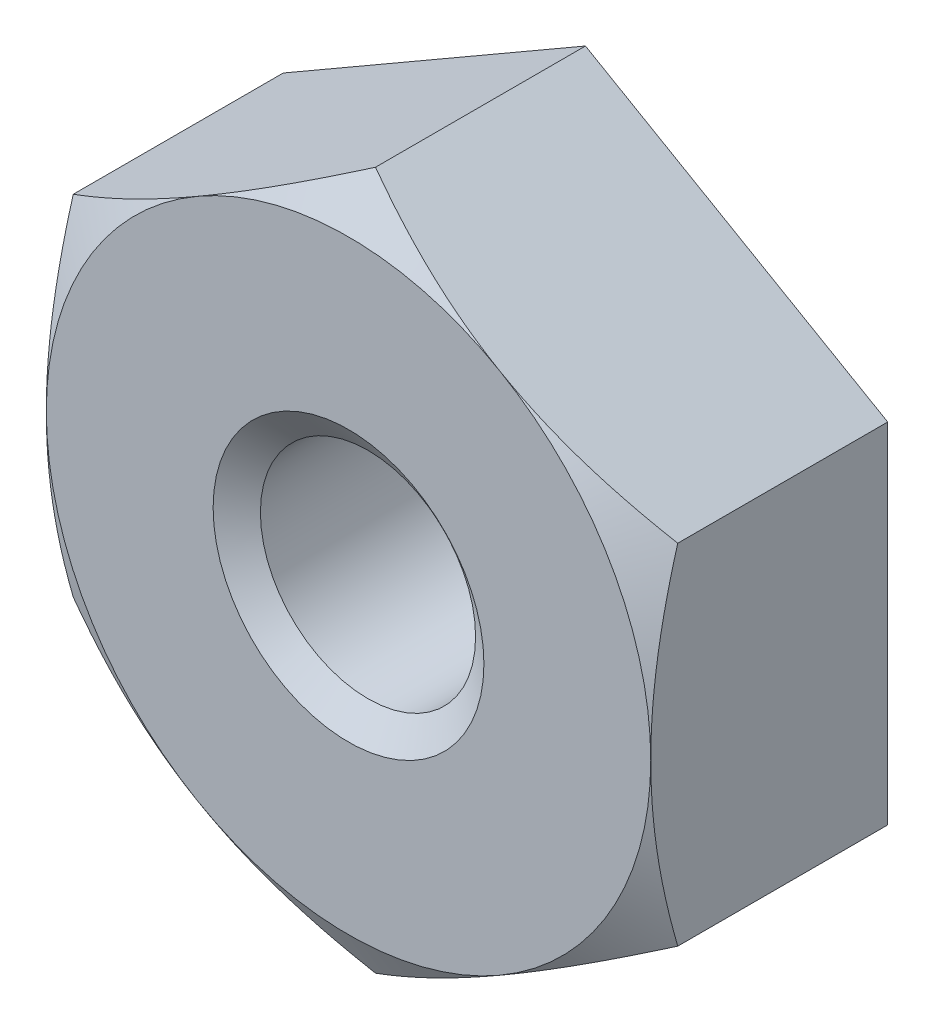
ISO-10303-21;
HEADER;
FILE_DESCRIPTION(('STEP AP214'),'2;1');
FILE_NAME('part.step','',(''),(''),'','','');
FILE_SCHEMA(('AUTOMOTIVE_DESIGN { 1 0 10303 214 1 1 1 1 }'));
ENDSEC;
DATA;
#1=APPLICATION_CONTEXT('core data for automotive mechanical design processes');
#2=APPLICATION_PROTOCOL_DEFINITION('international standard','automotive_design',2000,#1);
#3=PRODUCT_CONTEXT('',#1,'mechanical');
#4=PRODUCT('Part','Part','',(#3));
#5=PRODUCT_RELATED_PRODUCT_CATEGORY('part','',(#4));
#6=PRODUCT_DEFINITION_FORMATION('','',#4);
#7=PRODUCT_DEFINITION_CONTEXT('part definition',#1,'design');
#8=PRODUCT_DEFINITION('design','',#6,#7);
#9=PRODUCT_DEFINITION_SHAPE('','',#8);
#10=(LENGTH_UNIT() NAMED_UNIT(*) SI_UNIT(.MILLI.,.METRE.));
#11=(NAMED_UNIT(*) PLANE_ANGLE_UNIT() SI_UNIT($,.RADIAN.));
#12=(NAMED_UNIT(*) SI_UNIT($,.STERADIAN.) SOLID_ANGLE_UNIT());
#13=UNCERTAINTY_MEASURE_WITH_UNIT(LENGTH_MEASURE(1.E-05),#10,'distance_accuracy_value','');
#14=(GEOMETRIC_REPRESENTATION_CONTEXT(3) GLOBAL_UNCERTAINTY_ASSIGNED_CONTEXT((#13)) GLOBAL_UNIT_ASSIGNED_CONTEXT((#10,
#11,#12)) REPRESENTATION_CONTEXT('',''));
#15=CARTESIAN_POINT('',(0.,0.,0.));
#16=DIRECTION('',(0.,0.,1.));
#17=DIRECTION('',(1.,0.,0.));
#18=AXIS2_PLACEMENT_3D('',#15,#16,#17);
#19=CARTESIAN_POINT('',(0.,3.66617420935413,-2.4892));
#20=DIRECTION('',(0.,0.,-1.));
#21=DIRECTION('',(-1.,0.,0.));
#22=AXIS2_PLACEMENT_3D('',#19,#20,#21);
#23=PLANE('',#22);
#24=DIRECTION('',(-0.866025403784437,-0.500000000000002,0.));
#25=VECTOR('',#24,1.);
#26=CARTESIAN_POINT('',(0.,3.66617420935413,-2.4892));
#27=LINE('',#26,#25);
#28=CARTESIAN_POINT('',(0.,3.66617420935413,-2.4892));
#29=VERTEX_POINT('',#28);
#30=CARTESIAN_POINT('',(-3.175,1.83308710467706,-2.4892));
#31=VERTEX_POINT('',#30);
#32=EDGE_CURVE('E231',#29,#31,#27,.T.);
#33=ORIENTED_EDGE('',*,*,#32,.F.);
#34=DIRECTION('',(-0.866025403784438,0.500000000000001,0.));
#35=VECTOR('',#34,1.);
#36=CARTESIAN_POINT('',(3.175,1.83308710467706,-2.4892));
#37=LINE('',#36,#35);
#38=CARTESIAN_POINT('',(3.175,1.83308710467706,-2.4892));
#39=VERTEX_POINT('',#38);
#40=EDGE_CURVE('E496',#39,#29,#37,.T.);
#41=ORIENTED_EDGE('',*,*,#40,.F.);
#42=DIRECTION('',(0.,-1.,0.));
#43=VECTOR('',#42,1.);
#44=CARTESIAN_POINT('',(3.175,1.83308710467706,-2.4892));
#45=LINE('',#44,#43);
#46=CARTESIAN_POINT('',(3.175,-1.83308710467707,-2.4892));
#47=VERTEX_POINT('',#46);
#48=EDGE_CURVE('E491',#39,#47,#45,.T.);
#49=ORIENTED_EDGE('',*,*,#48,.T.);
#50=DIRECTION('',(0.866025403784438,0.500000000000002,0.));
#51=VECTOR('',#50,1.);
#52=CARTESIAN_POINT('',(0.,-3.66617420935414,-2.4892));
#53=LINE('',#52,#51);
#54=CARTESIAN_POINT('',(0.,-3.66617420935414,-2.4892));
#55=VERTEX_POINT('',#54);
#56=EDGE_CURVE('E485',#55,#47,#53,.T.);
#57=ORIENTED_EDGE('',*,*,#56,.F.);
#58=DIRECTION('',(0.866025403784438,-0.500000000000001,0.));
#59=VECTOR('',#58,1.);
#60=CARTESIAN_POINT('',(-3.175,-1.83308710467707,-2.4892));
#61=LINE('',#60,#59);
#62=CARTESIAN_POINT('',(-3.175,-1.83308710467707,-2.4892));
#63=VERTEX_POINT('',#62);
#64=EDGE_CURVE('E479',#63,#55,#61,.T.);
#65=ORIENTED_EDGE('',*,*,#64,.F.);
#66=DIRECTION('',(0.,-1.,0.));
#67=VECTOR('',#66,1.);
#68=CARTESIAN_POINT('',(-3.175,1.83308710467706,-2.4892));
#69=LINE('',#68,#67);
#70=EDGE_CURVE('E473',#31,#63,#69,.T.);
#71=ORIENTED_EDGE('',*,*,#70,.F.);
#72=EDGE_LOOP('',(#33,#41,#49,#57,#65,#71));
#73=FACE_BOUND('',#72,.T.);
#74=CARTESIAN_POINT('',(0.,0.,-2.4892));
#75=DIRECTION('',(0.,0.,-1.));
#76=DIRECTION('',(-1.,0.,0.));
#77=AXIS2_PLACEMENT_3D('',#74,#75,#76);
#78=CIRCLE('',#77,1.4224);
#79=CARTESIAN_POINT('',(-1.4224,0.,-2.4892));
#80=VERTEX_POINT('',#79);
#81=EDGE_CURVE('E235',#80,#80,#78,.F.);
#82=ORIENTED_EDGE('',*,*,#81,.T.);
#83=EDGE_LOOP('',(#82));
#84=FACE_BOUND('',#83,.T.);
#85=ADVANCED_FACE('F15',(#73,#84),#23,.T.);
#86=CARTESIAN_POINT('',(0.,3.66617420935413,0.));
#87=DIRECTION('',(0.,0.,-1.));
#88=DIRECTION('',(-1.,0.,0.));
#89=AXIS2_PLACEMENT_3D('',#86,#87,#88);
#90=PLANE('',#89);
#91=CARTESIAN_POINT('',(0.,0.,0.));
#92=DIRECTION('',(0.,0.,-1.));
#93=DIRECTION('',(-1.,0.,0.));
#94=AXIS2_PLACEMENT_3D('',#91,#92,#93);
#95=CIRCLE('',#94,3.175);
#96=CARTESIAN_POINT('',(-1.58750000000001,2.74963065701559,0.));
#97=VERTEX_POINT('',#96);
#98=CARTESIAN_POINT('',(-3.175,0.,0.));
#99=VERTEX_POINT('',#98);
#100=EDGE_CURVE('E20',#97,#99,#95,.F.);
#101=ORIENTED_EDGE('',*,*,#100,.T.);
#102=CARTESIAN_POINT('',(-1.5875,-2.74963065701559,0.));
#103=VERTEX_POINT('',#102);
#104=EDGE_CURVE('E10',#99,#103,#95,.F.);
#105=ORIENTED_EDGE('',*,*,#104,.T.);
#106=CARTESIAN_POINT('',(1.58750000000001,-2.74963065701559,0.));
#107=VERTEX_POINT('',#106);
#108=EDGE_CURVE('E26',#103,#107,#95,.F.);
#109=ORIENTED_EDGE('',*,*,#108,.T.);
#110=CARTESIAN_POINT('',(3.175,0.,0.));
#111=VERTEX_POINT('',#110);
#112=EDGE_CURVE('E116',#107,#111,#95,.F.);
#113=ORIENTED_EDGE('',*,*,#112,.T.);
#114=CARTESIAN_POINT('',(0.,0.,0.));
#115=DIRECTION('',(0.,0.,1.));
#116=DIRECTION('',(1.,0.,0.));
#117=AXIS2_PLACEMENT_3D('',#114,#115,#116);
#118=CIRCLE('',#117,3.175);
#119=CARTESIAN_POINT('',(1.5875,2.74963065701559,0.));
#120=VERTEX_POINT('',#119);
#121=EDGE_CURVE('E129',#111,#120,#118,.T.);
#122=ORIENTED_EDGE('',*,*,#121,.T.);
#123=EDGE_CURVE('E146',#120,#97,#95,.F.);
#124=ORIENTED_EDGE('',*,*,#123,.T.);
#125=EDGE_LOOP('',(#101,#105,#109,#113,#122,#124));
#126=FACE_BOUND('',#125,.T.);
#127=CARTESIAN_POINT('',(0.,0.,0.));
#128=DIRECTION('',(0.,0.,1.));
#129=DIRECTION('',(1.,0.,0.));
#130=AXIS2_PLACEMENT_3D('',#127,#128,#129);
#131=CIRCLE('',#130,1.4224);
#132=CARTESIAN_POINT('',(1.4224,0.,0.));
#133=VERTEX_POINT('',#132);
#134=EDGE_CURVE('E239',#133,#133,#131,.T.);
#135=ORIENTED_EDGE('',*,*,#134,.F.);
#136=EDGE_LOOP('',(#135));
#137=FACE_BOUND('',#136,.T.);
#138=ADVANCED_FACE('F142',(#126,#137),#90,.F.);
#139=CARTESIAN_POINT('',(0.,3.66617420935413,-2.4892));
#140=DIRECTION('',(-0.500000000000002,0.866025403784438,0.));
#141=DIRECTION('',(-0.866025403784438,-0.500000000000002,0.));
#142=AXIS2_PLACEMENT_3D('',#139,#140,#141);
#143=PLANE('',#142);
#144=DIRECTION('',(0.,0.,1.));
#145=VECTOR('',#144,1.);
#146=CARTESIAN_POINT('',(-3.175,1.83308710467706,-2.4892));
#147=LINE('',#146,#145);
#148=CARTESIAN_POINT('',(-3.175,1.83308710467706,-0.283579561989607));
#149=VERTEX_POINT('',#148);
#150=EDGE_CURVE('E501',#31,#149,#147,.T.);
#151=ORIENTED_EDGE('',*,*,#150,.T.);
#152=CARTESIAN_POINT('',(-3.1752,1.83297163462322,-0.283646231805778));
#153=CARTESIAN_POINT('',(-3.03567460326018,1.91352665998974,-0.237119934023207));
#154=CARTESIAN_POINT('',(-2.89494483272887,1.99477703088899,-0.194805864908322));
#155=CARTESIAN_POINT('',(-2.61104837470026,2.15868472735379,-0.120946008708286));
#156=CARTESIAN_POINT('',(-2.46787664251628,2.24134496547055,-0.0894263509090421));
#157=CARTESIAN_POINT('',(-2.18330753500983,2.40564101629246,-0.0403611049832709));
#158=CARTESIAN_POINT('',(-2.0419539457708,2.48725154909053,-0.0224889669031262));
#159=CARTESIAN_POINT('',(-1.75858160224329,2.65085664790703,-0.00115281403229686));
#160=CARTESIAN_POINT('',(-1.61656387803407,2.73285061920892,0.00232886836810175));
#161=CARTESIAN_POINT('',(-1.35119263453263,2.88606277807967,-0.00491170072221306));
#162=CARTESIAN_POINT('',(-1.22779940341379,2.95730389328231,-0.013856146143631));
#163=CARTESIAN_POINT('',(-0.981816852669883,3.09932198517026,-0.0422055763684445));
#164=CARTESIAN_POINT('',(-0.859228383940737,3.17009847059057,-0.0616202467099069));
#165=CARTESIAN_POINT('',(-0.612738605574497,3.31240941048281,-0.110155730811223));
#166=CARTESIAN_POINT('',(-0.488868495421441,3.38392585192423,-0.139482298472806));
#167=CARTESIAN_POINT('',(-0.242975839646995,3.52589204292736,-0.20604219366216));
#168=CARTESIAN_POINT('',(-0.120950143425913,3.59634361148865,-0.243259880449916));
#169=CARTESIAN_POINT('',(0.000199999999999186,3.66628967940796,-0.283646231805781));
#170=B_SPLINE_CURVE_WITH_KNOTS('',3,(#152,#153,#154,#155,#156,#157,#158,#159,#160,#161,#162,
#163,#164,#165,#166,#167,#168,#169),.UNSPECIFIED.,.F.,.F.,(4,2,2,2,2,2,2,2,4),(0.,
0.503278731073368,1.00776724301492,1.49976968502821,1.99116790059651,2.41904879402149,
2.84732618162394,3.28510386250597,3.72202181665389),.UNSPECIFIED.);
#171=EDGE_CURVE('E45',#149,#97,#170,.T.);
#172=ORIENTED_EDGE('',*,*,#171,.T.);
#173=CARTESIAN_POINT('',(0.,3.66617420935413,-0.283579561989607));
#174=VERTEX_POINT('',#173);
#175=EDGE_CURVE('E159',#97,#174,#170,.T.);
#176=ORIENTED_EDGE('',*,*,#175,.T.);
#177=DIRECTION('',(0.,0.,1.));
#178=VECTOR('',#177,1.);
#179=CARTESIAN_POINT('',(0.,3.66617420935413,-2.4892));
#180=LINE('',#179,#178);
#181=EDGE_CURVE('E526',#29,#174,#180,.T.);
#182=ORIENTED_EDGE('',*,*,#181,.F.);
#183=ORIENTED_EDGE('',*,*,#32,.T.);
#184=EDGE_LOOP('',(#151,#172,#176,#182,#183));
#185=FACE_BOUND('',#184,.T.);
#186=ADVANCED_FACE('F17',(#185),#143,.T.);
#187=CARTESIAN_POINT('',(3.175,1.83308710467706,-2.4892));
#188=DIRECTION('',(0.500000000000001,0.866025403784438,0.));
#189=DIRECTION('',(-0.866025403784438,0.500000000000001,0.));
#190=AXIS2_PLACEMENT_3D('',#187,#188,#189);
#191=PLANE('',#190);
#192=ORIENTED_EDGE('',*,*,#181,.T.);
#193=CARTESIAN_POINT('',(-0.000200000000001121,3.66628967940796,-0.283646231805781));
#194=CARTESIAN_POINT('',(0.139325396739818,3.58573465404144,-0.23711993402321));
#195=CARTESIAN_POINT('',(0.280055167271128,3.50448428314219,-0.194805864908325));
#196=CARTESIAN_POINT('',(0.563951625299741,3.34057658667739,-0.120946008708289));
#197=CARTESIAN_POINT('',(0.707123357483717,3.25791634856063,-0.0894263509090441));
#198=CARTESIAN_POINT('',(0.991692464990167,3.09362029773873,-0.0403611049832722));
#199=CARTESIAN_POINT('',(1.1330460542292,3.01200976494065,-0.0224889669031271));
#200=CARTESIAN_POINT('',(1.41641839775671,2.84840466612415,-0.00115281403229733));
#201=CARTESIAN_POINT('',(1.55843612196593,2.76641069482226,0.0023288683681013));
#202=CARTESIAN_POINT('',(1.82380736546737,2.61319853595151,-0.00491170072221313));
#203=CARTESIAN_POINT('',(1.94720059658621,2.54195742074887,-0.0138561461436307));
#204=CARTESIAN_POINT('',(2.19318314733012,2.39993932886093,-0.0422055763684437));
#205=CARTESIAN_POINT('',(2.31577161605926,2.32916284344061,-0.0616202467099058));
#206=CARTESIAN_POINT('',(2.5622613944255,2.18685190354837,-0.110155730811222));
#207=CARTESIAN_POINT('',(2.68613150457856,2.11533546210696,-0.139482298472804));
#208=CARTESIAN_POINT('',(2.93202416035301,1.97336927110383,-0.206042193662158));
#209=CARTESIAN_POINT('',(3.05404985657409,1.90291770254253,-0.243259880449914));
#210=CARTESIAN_POINT('',(3.1752,1.83297163462322,-0.283646231805778));
#211=B_SPLINE_CURVE_WITH_KNOTS('',3,(#193,#194,#195,#196,#197,#198,#199,#200,#201,#202,#203,
#204,#205,#206,#207,#208,#209,#210),.UNSPECIFIED.,.F.,.F.,(4,2,2,2,2,2,2,2,4),(0.,
0.503278731073369,1.00776724301492,1.49976968502821,1.99116790059651,2.41904879402149,
2.84732618162394,3.28510386250597,3.72202181665389),.UNSPECIFIED.);
#212=EDGE_CURVE('E156',#174,#120,#211,.T.);
#213=ORIENTED_EDGE('',*,*,#212,.T.);
#214=CARTESIAN_POINT('',(3.175,1.83308710467707,-0.283579561989607));
#215=VERTEX_POINT('',#214);
#216=EDGE_CURVE('E132',#120,#215,#211,.T.);
#217=ORIENTED_EDGE('',*,*,#216,.T.);
#218=DIRECTION('',(0.,0.,1.));
#219=VECTOR('',#218,1.);
#220=CARTESIAN_POINT('',(3.175,1.83308710467706,-2.4892));
#221=LINE('',#220,#219);
#222=EDGE_CURVE('E150',#39,#215,#221,.T.);
#223=ORIENTED_EDGE('',*,*,#222,.F.);
#224=ORIENTED_EDGE('',*,*,#40,.T.);
#225=EDGE_LOOP('',(#192,#213,#217,#223,#224));
#226=FACE_BOUND('',#225,.T.);
#227=ADVANCED_FACE('F364',(#226),#191,.T.);
#228=CARTESIAN_POINT('',(3.175,1.83308710467706,-2.4892));
#229=DIRECTION('',(-1.,0.,0.));
#230=DIRECTION('',(0.,0.,1.));
#231=AXIS2_PLACEMENT_3D('',#228,#229,#230);
#232=PLANE('',#231);
#233=CARTESIAN_POINT('',(3.175,-4.8616171420299,-1.51932228935976));
#234=CARTESIAN_POINT('',(3.175,-4.7222166877445,-1.45195628992123));
#235=CARTESIAN_POINT('',(3.175,-4.58248664475634,-1.38525996427212));
#236=CARTESIAN_POINT('',(3.175,-4.30218917292502,-1.25358933527025));
#237=CARTESIAN_POINT('',(3.175,-4.16162160419068,-1.18861533006649));
#238=CARTESIAN_POINT('',(3.175,-3.87871153776028,-1.06042973005273));
#239=CARTESIAN_POINT('',(3.175,-3.73636348618431,-0.997230348581289));
#240=CARTESIAN_POINT('',(3.175,-3.4504974070564,-0.873546152177363));
#241=CARTESIAN_POINT('',(3.175,-3.30697944095183,-0.813061195746994));
#242=CARTESIAN_POINT('',(3.175,-3.01676360978826,-0.694809578750527));
#243=CARTESIAN_POINT('',(3.175,-2.87004833678074,-0.637085406846329));
#244=CARTESIAN_POINT('',(3.175,-2.57488727143506,-0.526158008324041));
#245=CARTESIAN_POINT('',(3.175,-2.42644128864792,-0.472955284693414));
#246=CARTESIAN_POINT('',(3.175,-2.12788752613931,-0.372500325317014));
#247=CARTESIAN_POINT('',(3.175,-1.97778404697074,-0.325235438859672));
#248=CARTESIAN_POINT('',(3.175,-1.67544317117207,-0.238191164257203));
#249=CARTESIAN_POINT('',(3.175,-1.52320646578688,-0.198409408930923));
#250=CARTESIAN_POINT('',(3.175,-1.21649515954196,-0.128262693494771));
#251=CARTESIAN_POINT('',(3.175,-1.06201997425122,-0.0979002407280043));
#252=CARTESIAN_POINT('',(3.175,-0.751207163661342,-0.0486364247633605));
#253=CARTESIAN_POINT('',(3.175,-0.594869536715697,-0.0297350716985363));
#254=CARTESIAN_POINT('',(3.175,-0.282140016767181,-0.00506556418736515));
#255=CARTESIAN_POINT('',(3.175,-0.125754853180873,0.000785733729076548));
#256=CARTESIAN_POINT('',(3.175,0.186905967950927,-0.00095572768499411));
#257=CARTESIAN_POINT('',(3.175,0.343181643385311,-0.00854499720968487));
#258=CARTESIAN_POINT('',(3.175,0.610045004210252,-0.0324474955995379));
#259=CARTESIAN_POINT('',(3.175,0.720927103340567,-0.0456480037348537));
#260=CARTESIAN_POINT('',(3.175,0.941834770691507,-0.0779568944626868));
#261=CARTESIAN_POINT('',(3.175,1.05186020102054,-0.097066208790142));
#262=CARTESIAN_POINT('',(3.175,1.38056179828294,-0.162254462566746));
#263=CARTESIAN_POINT('',(3.175,1.59769723107173,-0.216176928599965));
#264=CARTESIAN_POINT('',(3.175,1.92260738330278,-0.30917861020803));
#265=CARTESIAN_POINT('',(3.175,2.03207569486971,-0.342672941312986));
#266=CARTESIAN_POINT('',(3.175,2.24986976286739,-0.412975885555787));
#267=CARTESIAN_POINT('',(3.175,2.35819625057448,-0.449782212723362));
#268=CARTESIAN_POINT('',(3.175,2.57325368409845,-0.525943273724352));
#269=CARTESIAN_POINT('',(3.175,2.67999017870302,-0.565282497316841));
#270=CARTESIAN_POINT('',(3.175,2.89263503540125,-0.64626994332137));
#271=CARTESIAN_POINT('',(3.175,2.99854304277513,-0.687919098952175));
#272=CARTESIAN_POINT('',(3.175,3.1040681107068,-0.730495273942548));
#273=B_SPLINE_CURVE_WITH_KNOTS('',3,(#233,#234,#235,#236,#237,#238,#239,#240,#241,#242,#243,
#244,#245,#246,#247,#248,#249,#250,#251,#252,#253,#254,#255,#256,#257,#258,#259,#260,#261,#262,
#263,#264,#265,#266,#267,#268,#269,#270,#271,#272),.UNSPECIFIED.,.F.,.F.,(4,2,2,2,2,2,2,2,2,2,2,
2,2,2,2,2,2,2,2,4),(0.,0.464480110322491,0.929040108038169,1.39625859500254,1.86345269838581,
2.33638249541753,2.80936483473485,3.28132173853721,3.7531290935448,4.22506193235102,
4.69699518840458,5.16591300646642,5.63470908917535,5.96954086780258,6.30442547160104,
6.97469308766865,7.31809942506291,7.66127053211061,8.00251004161233,8.34388843151022),.UNSPECIFIED.);
#274=CARTESIAN_POINT('',(3.175,-1.83308710467707,-0.283579561989607));
#275=VERTEX_POINT('',#274);
#276=EDGE_CURVE('E112',#275,#111,#273,.T.);
#277=ORIENTED_EDGE('',*,*,#276,.F.);
#278=DIRECTION('',(0.,0.,1.));
#279=VECTOR('',#278,1.);
#280=CARTESIAN_POINT('',(3.175,-1.83308710467707,-2.4892));
#281=LINE('',#280,#279);
#282=EDGE_CURVE('E517',#47,#275,#281,.T.);
#283=ORIENTED_EDGE('',*,*,#282,.F.);
#284=ORIENTED_EDGE('',*,*,#48,.F.);
#285=ORIENTED_EDGE('',*,*,#222,.T.);
#286=EDGE_CURVE('E126',#111,#215,#273,.T.);
#287=ORIENTED_EDGE('',*,*,#286,.F.);
#288=EDGE_LOOP('',(#277,#283,#284,#285,#287));
#289=FACE_BOUND('',#288,.T.);
#290=ADVANCED_FACE('F148',(#289),#232,.F.);
#291=CARTESIAN_POINT('',(0.,-3.66617420935414,-2.4892));
#292=DIRECTION('',(0.500000000000002,-0.866025403784438,0.));
#293=DIRECTION('',(0.866025403784438,0.500000000000002,0.));
#294=AXIS2_PLACEMENT_3D('',#291,#292,#293);
#295=PLANE('',#294);
#296=ORIENTED_EDGE('',*,*,#282,.T.);
#297=CARTESIAN_POINT('',(3.1752,-1.83297163462323,-0.283646231805781));
#298=CARTESIAN_POINT('',(3.03567460326018,-1.91352665998975,-0.23711993402321));
#299=CARTESIAN_POINT('',(2.89494483272887,-1.994777030889,-0.194805864908326));
#300=CARTESIAN_POINT('',(2.61104837470026,-2.1586847273538,-0.12094600870829));
#301=CARTESIAN_POINT('',(2.46787664251628,-2.24134496547057,-0.0894263509090457));
#302=CARTESIAN_POINT('',(2.18330753500983,-2.40564101629247,-0.0403611049832748));
#303=CARTESIAN_POINT('',(2.0419539457708,-2.48725154909054,-0.0224889669031304));
#304=CARTESIAN_POINT('',(1.75858160224329,-2.65085664790704,-0.00115281403230171));
#305=CARTESIAN_POINT('',(1.61656387803407,-2.73285061920894,0.0023288683680965));
#306=CARTESIAN_POINT('',(1.35119263453262,-2.88606277807968,-0.00491170072221867));
#307=CARTESIAN_POINT('',(1.22779940341379,-2.95730389328232,-0.0138561461436366));
#308=CARTESIAN_POINT('',(0.981816852669881,-3.09932198517027,-0.0422055763684503));
#309=CARTESIAN_POINT('',(0.859228383940735,-3.17009847059058,-0.0616202467099128));
#310=CARTESIAN_POINT('',(0.612738605574496,-3.31240941048282,-0.110155730811229));
#311=CARTESIAN_POINT('',(0.488868495421441,-3.38392585192424,-0.139482298472812));
#312=CARTESIAN_POINT('',(0.242975839646995,-3.52589204292737,-0.206042193662165));
#313=CARTESIAN_POINT('',(0.120950143425914,-3.59634361148866,-0.243259880449921));
#314=CARTESIAN_POINT('',(-0.000199999999998958,-3.66628967940797,-0.283646231805786));
#315=B_SPLINE_CURVE_WITH_KNOTS('',3,(#297,#298,#299,#300,#301,#302,#303,#304,#305,#306,#307,
#308,#309,#310,#311,#312,#313,#314),.UNSPECIFIED.,.F.,.F.,(4,2,2,2,2,2,2,2,4),(0.,
0.503278731073368,1.00776724301492,1.49976968502821,1.99116790059651,2.41904879402149,
2.84732618162394,3.28510386250597,3.72202181665389),.UNSPECIFIED.);
#316=EDGE_CURVE('E119',#275,#107,#315,.T.);
#317=ORIENTED_EDGE('',*,*,#316,.T.);
#318=CARTESIAN_POINT('',(0.,-3.66617420935413,-0.283579561989607));
#319=VERTEX_POINT('',#318);
#320=EDGE_CURVE('E166',#107,#319,#315,.T.);
#321=ORIENTED_EDGE('',*,*,#320,.T.);
#322=DIRECTION('',(0.,0.,1.));
#323=VECTOR('',#322,1.);
#324=CARTESIAN_POINT('',(0.,-3.66617420935414,-2.4892));
#325=LINE('',#324,#323);
#326=EDGE_CURVE('E511',#55,#319,#325,.T.);
#327=ORIENTED_EDGE('',*,*,#326,.F.);
#328=ORIENTED_EDGE('',*,*,#56,.T.);
#329=EDGE_LOOP('',(#296,#317,#321,#327,#328));
#330=FACE_BOUND('',#329,.T.);
#331=ADVANCED_FACE('F209',(#330),#295,.T.);
#332=CARTESIAN_POINT('',(-3.175,-1.83308710467707,-2.4892));
#333=DIRECTION('',(-0.500000000000001,-0.866025403784438,0.));
#334=DIRECTION('',(0.866025403784438,-0.500000000000001,0.));
#335=AXIS2_PLACEMENT_3D('',#332,#333,#334);
#336=PLANE('',#335);
#337=ORIENTED_EDGE('',*,*,#326,.T.);
#338=CARTESIAN_POINT('',(0.000200000000000814,-3.66628967940797,-0.283646231805787));
#339=CARTESIAN_POINT('',(-0.139325396739818,-3.58573465404145,-0.237119934023216));
#340=CARTESIAN_POINT('',(-0.280055167271129,-3.5044842831422,-0.194805864908331));
#341=CARTESIAN_POINT('',(-0.563951625299743,-3.3405765866774,-0.120946008708294));
#342=CARTESIAN_POINT('',(-0.70712335748372,-3.25791634856064,-0.089426350909049));
#343=CARTESIAN_POINT('',(-0.99169246499017,-3.09362029773874,-0.0403611049832773));
#344=CARTESIAN_POINT('',(-1.1330460542292,-3.01200976494066,-0.0224889669031325));
#345=CARTESIAN_POINT('',(-1.41641839775671,-2.84840466612416,-0.00115281403230277));
#346=CARTESIAN_POINT('',(-1.55843612196593,-2.76641069482227,0.00232886836809603));
#347=CARTESIAN_POINT('',(-1.82380736546738,-2.61319853595152,-0.00491170072221836));
#348=CARTESIAN_POINT('',(-1.94720059658622,-2.54195742074888,-0.013856146143636));
#349=CARTESIAN_POINT('',(-2.19318314733012,-2.39993932886094,-0.0422055763684489));
#350=CARTESIAN_POINT('',(-2.31577161605927,-2.32916284344062,-0.0616202467099109));
#351=CARTESIAN_POINT('',(-2.56226139442551,-2.18685190354838,-0.110155730811227));
#352=CARTESIAN_POINT('',(-2.68613150457856,-2.11533546210697,-0.139482298472808));
#353=CARTESIAN_POINT('',(-2.93202416035301,-1.97336927110384,-0.206042193662161));
#354=CARTESIAN_POINT('',(-3.05404985657409,-1.90291770254254,-0.243259880449917));
#355=CARTESIAN_POINT('',(-3.1752,-1.83297163462323,-0.283646231805782));
#356=B_SPLINE_CURVE_WITH_KNOTS('',3,(#338,#339,#340,#341,#342,#343,#344,#345,#346,#347,#348,
#349,#350,#351,#352,#353,#354,#355),.UNSPECIFIED.,.F.,.F.,(4,2,2,2,2,2,2,2,4),(0.,
0.50327873107337,1.00776724301493,1.49976968502822,1.99116790059652,2.41904879402149,
2.84732618162394,3.28510386250598,3.72202181665389),.UNSPECIFIED.);
#357=EDGE_CURVE('E203',#319,#103,#356,.T.);
#358=ORIENTED_EDGE('',*,*,#357,.T.);
#359=CARTESIAN_POINT('',(-3.175,-1.83308710467707,-0.283579561989607));
#360=VERTEX_POINT('',#359);
#361=EDGE_CURVE('E195',#103,#360,#356,.T.);
#362=ORIENTED_EDGE('',*,*,#361,.T.);
#363=DIRECTION('',(0.,0.,1.));
#364=VECTOR('',#363,1.);
#365=CARTESIAN_POINT('',(-3.175,-1.83308710467707,-2.4892));
#366=LINE('',#365,#364);
#367=EDGE_CURVE('E507',#63,#360,#366,.T.);
#368=ORIENTED_EDGE('',*,*,#367,.F.);
#369=ORIENTED_EDGE('',*,*,#64,.T.);
#370=EDGE_LOOP('',(#337,#358,#362,#368,#369));
#371=FACE_BOUND('',#370,.T.);
#372=ADVANCED_FACE('F205',(#371),#336,.T.);
#373=CARTESIAN_POINT('',(-3.175,1.83308710467706,-2.4892));
#374=DIRECTION('',(-1.,0.,0.));
#375=DIRECTION('',(0.,0.,1.));
#376=AXIS2_PLACEMENT_3D('',#373,#374,#375);
#377=PLANE('',#376);
#378=ORIENTED_EDGE('',*,*,#367,.T.);
#379=CARTESIAN_POINT('',(-3.175,-4.8616171420299,-1.51932228935976));
#380=CARTESIAN_POINT('',(-3.175,-4.7222166877445,-1.45195628992123));
#381=CARTESIAN_POINT('',(-3.175,-4.58248664475634,-1.38525996427213));
#382=CARTESIAN_POINT('',(-3.175,-4.30218917292502,-1.25358933527025));
#383=CARTESIAN_POINT('',(-3.175,-4.16162160419068,-1.18861533006649));
#384=CARTESIAN_POINT('',(-3.175,-3.87871153776028,-1.06042973005273));
#385=CARTESIAN_POINT('',(-3.175,-3.73636348618432,-0.997230348581291));
#386=CARTESIAN_POINT('',(-3.175,-3.45049740705641,-0.873546152177365));
#387=CARTESIAN_POINT('',(-3.175,-3.30697944095184,-0.813061195746995));
#388=CARTESIAN_POINT('',(-3.175,-3.01676360978827,-0.694809578750529));
#389=CARTESIAN_POINT('',(-3.175,-2.87004833678074,-0.637085406846331));
#390=CARTESIAN_POINT('',(-3.175,-2.57488727143507,-0.526158008324042));
#391=CARTESIAN_POINT('',(-3.175,-2.42644128864793,-0.472955284693415));
#392=CARTESIAN_POINT('',(-3.175,-2.12788752613931,-0.372500325317014));
#393=CARTESIAN_POINT('',(-3.175,-1.97778404697074,-0.325235438859673));
#394=CARTESIAN_POINT('',(-3.175,-1.67544317117207,-0.238191164257204));
#395=CARTESIAN_POINT('',(-3.175,-1.52320646578689,-0.198409408930923));
#396=CARTESIAN_POINT('',(-3.175,-1.21649515954197,-0.128262693494772));
#397=CARTESIAN_POINT('',(-3.175,-1.06201997425122,-0.0979002407280046));
#398=CARTESIAN_POINT('',(-3.175,-0.751207163661344,-0.0486364247633607));
#399=CARTESIAN_POINT('',(-3.175,-0.594869536715699,-0.0297350716985364));
#400=CARTESIAN_POINT('',(-3.175,-0.282140016767183,-0.00506556418736514));
#401=CARTESIAN_POINT('',(-3.175,-0.125754853180875,0.000785733729076502));
#402=CARTESIAN_POINT('',(-3.175,0.186905967950925,-0.000955727684994063));
#403=CARTESIAN_POINT('',(-3.175,0.34318164338531,-0.00854499720968466));
#404=CARTESIAN_POINT('',(-3.175,0.61004500421025,-0.0324474955995377));
#405=CARTESIAN_POINT('',(-3.175,0.720927103340565,-0.0456480037348534));
#406=CARTESIAN_POINT('',(-3.175,0.941834770691505,-0.0779568944626865));
#407=CARTESIAN_POINT('',(-3.175,1.05186020102054,-0.0970662087901415));
#408=CARTESIAN_POINT('',(-3.175,1.38056179828294,-0.162254462566745));
#409=CARTESIAN_POINT('',(-3.175,1.59769723107173,-0.216176928599965));
#410=CARTESIAN_POINT('',(-3.175,1.92260738330278,-0.30917861020803));
#411=CARTESIAN_POINT('',(-3.175,2.03207569486971,-0.342672941312986));
#412=CARTESIAN_POINT('',(-3.175,2.24986976286739,-0.412975885555786));
#413=CARTESIAN_POINT('',(-3.175,2.35819625057448,-0.449782212723361));
#414=CARTESIAN_POINT('',(-3.175,2.57325368409845,-0.525943273724352));
#415=CARTESIAN_POINT('',(-3.175,2.67999017870302,-0.56528249731684));
#416=CARTESIAN_POINT('',(-3.175,2.89263503540125,-0.646269943321369));
#417=CARTESIAN_POINT('',(-3.175,2.99854304277513,-0.687919098952173));
#418=CARTESIAN_POINT('',(-3.175,3.1040681107068,-0.730495273942547));
#419=B_SPLINE_CURVE_WITH_KNOTS('',3,(#379,#380,#381,#382,#383,#384,#385,#386,#387,#388,#389,
#390,#391,#392,#393,#394,#395,#396,#397,#398,#399,#400,#401,#402,#403,#404,#405,#406,#407,#408,
#409,#410,#411,#412,#413,#414,#415,#416,#417,#418),.UNSPECIFIED.,.F.,.F.,(4,2,2,2,2,2,2,2,2,2,2,
2,2,2,2,2,2,2,2,4),(0.,0.46448011032249,0.929040108038168,1.39625859500254,1.86345269838581,
2.33638249541753,2.80936483473484,3.2813217385372,3.7531290935448,4.22506193235102,
4.69699518840458,5.16591300646642,5.63470908917535,5.96954086780258,6.30442547160104,
6.97469308766865,7.31809942506291,7.66127053211061,8.00251004161233,8.34388843151022),.UNSPECIFIED.);
#420=EDGE_CURVE('E204',#360,#99,#419,.T.);
#421=ORIENTED_EDGE('',*,*,#420,.T.);
#422=EDGE_CURVE('E138',#99,#149,#419,.T.);
#423=ORIENTED_EDGE('',*,*,#422,.T.);
#424=ORIENTED_EDGE('',*,*,#150,.F.);
#425=ORIENTED_EDGE('',*,*,#70,.T.);
#426=EDGE_LOOP('',(#378,#421,#423,#424,#425));
#427=FACE_BOUND('',#426,.T.);
#428=ADVANCED_FACE('F208',(#427),#377,.T.);
#429=CARTESIAN_POINT('',(0.,0.,0.));
#430=DIRECTION('',(0.,0.,-1.));
#431=DIRECTION('',(-1.,0.,0.));
#432=AXIS2_PLACEMENT_3D('',#429,#430,#431);
#433=CONICAL_SURFACE('',#432,3.175,1.0471975511966);
#434=ORIENTED_EDGE('',*,*,#422,.F.);
#435=ORIENTED_EDGE('',*,*,#100,.F.);
#436=ORIENTED_EDGE('',*,*,#171,.F.);
#437=EDGE_LOOP('',(#434,#435,#436));
#438=FACE_BOUND('',#437,.T.);
#439=ADVANCED_FACE('F214',(#438),#433,.T.);
#440=ORIENTED_EDGE('',*,*,#123,.F.);
#441=ORIENTED_EDGE('',*,*,#212,.F.);
#442=ORIENTED_EDGE('',*,*,#175,.F.);
#443=EDGE_LOOP('',(#440,#441,#442));
#444=FACE_BOUND('',#443,.T.);
#445=ADVANCED_FACE('F184',(#444),#433,.T.);
#446=ORIENTED_EDGE('',*,*,#121,.F.);
#447=ORIENTED_EDGE('',*,*,#286,.T.);
#448=ORIENTED_EDGE('',*,*,#216,.F.);
#449=EDGE_LOOP('',(#446,#447,#448));
#450=FACE_BOUND('',#449,.T.);
#451=ADVANCED_FACE('F130',(#450),#433,.T.);
#452=ORIENTED_EDGE('',*,*,#276,.T.);
#453=ORIENTED_EDGE('',*,*,#112,.F.);
#454=ORIENTED_EDGE('',*,*,#316,.F.);
#455=EDGE_LOOP('',(#452,#453,#454));
#456=FACE_BOUND('',#455,.T.);
#457=ADVANCED_FACE('F114',(#456),#433,.T.);
#458=ORIENTED_EDGE('',*,*,#108,.F.);
#459=ORIENTED_EDGE('',*,*,#357,.F.);
#460=ORIENTED_EDGE('',*,*,#320,.F.);
#461=EDGE_LOOP('',(#458,#459,#460));
#462=FACE_BOUND('',#461,.T.);
#463=ADVANCED_FACE('F183',(#462),#433,.T.);
#464=ORIENTED_EDGE('',*,*,#104,.F.);
#465=ORIENTED_EDGE('',*,*,#420,.F.);
#466=ORIENTED_EDGE('',*,*,#361,.F.);
#467=EDGE_LOOP('',(#464,#465,#466));
#468=FACE_BOUND('',#467,.T.);
#469=ADVANCED_FACE('F177',(#468),#433,.T.);
#470=CARTESIAN_POINT('',(0.,0.,-25.0375057290932));
#471=DIRECTION('',(0.,0.,1.));
#472=DIRECTION('',(1.,0.,0.));
#473=AXIS2_PLACEMENT_3D('',#470,#471,#472);
#474=CYLINDRICAL_SURFACE('',#473,1.4224);
#475=ORIENTED_EDGE('',*,*,#81,.F.);
#476=EDGE_LOOP('',(#475));
#477=FACE_BOUND('',#476,.T.);
#478=CARTESIAN_POINT('',(0.,0.,-2.4638));
#479=DIRECTION('',(0.,0.,1.));
#480=DIRECTION('',(1.,0.,0.));
#481=AXIS2_PLACEMENT_3D('',#478,#479,#480);
#482=CIRCLE('',#481,1.4224);
#483=CARTESIAN_POINT('',(1.4224,0.,-2.4638));
#484=VERTEX_POINT('',#483);
#485=EDGE_CURVE('E139',#484,#484,#482,.T.);
#486=ORIENTED_EDGE('',*,*,#485,.T.);
#487=EDGE_LOOP('',(#486));
#488=FACE_BOUND('',#487,.T.);
#489=ADVANCED_FACE('F182',(#477,#488),#474,.F.);
#490=CARTESIAN_POINT('',(0.,0.,-2.4638));
#491=DIRECTION('',(0.,0.,-1.));
#492=DIRECTION('',(-1.,0.,0.));
#493=AXIS2_PLACEMENT_3D('',#490,#491,#492);
#494=CONICAL_SURFACE('',#493,1.4224,0.959931088596882);
#495=ORIENTED_EDGE('',*,*,#485,.F.);
#496=EDGE_LOOP('',(#495));
#497=FACE_BOUND('',#496,.T.);
#498=CARTESIAN_POINT('',(0.,0.,-2.25926937808894));
#499=DIRECTION('',(0.,0.,-1.));
#500=DIRECTION('',(-1.,0.,0.));
#501=AXIS2_PLACEMENT_3D('',#498,#499,#500);
#502=CIRCLE('',#501,1.1303);
#503=CARTESIAN_POINT('',(-1.1303,0.,-2.25926937808894));
#504=VERTEX_POINT('',#503);
#505=EDGE_CURVE('E247',#504,#504,#502,.F.);
#506=ORIENTED_EDGE('',*,*,#505,.T.);
#507=EDGE_LOOP('',(#506));
#508=FACE_BOUND('',#507,.T.);
#509=ADVANCED_FACE('F261',(#497,#508),#494,.F.);
#510=CARTESIAN_POINT('',(0.,0.,-0.224983684102165));
#511=DIRECTION('',(0.,0.,1.));
#512=DIRECTION('',(1.,0.,0.));
#513=AXIS2_PLACEMENT_3D('',#510,#511,#512);
#514=CONICAL_SURFACE('',#513,1.10109,0.959931088596874);
#515=ORIENTED_EDGE('',*,*,#134,.T.);
#516=EDGE_LOOP('',(#515));
#517=FACE_BOUND('',#516,.T.);
#518=CARTESIAN_POINT('',(0.,0.,-0.204530621911059));
#519=DIRECTION('',(0.,0.,1.));
#520=DIRECTION('',(1.,0.,0.));
#521=AXIS2_PLACEMENT_3D('',#518,#519,#520);
#522=CIRCLE('',#521,1.1303);
#523=CARTESIAN_POINT('',(1.1303,0.,-0.204530621911059));
#524=VERTEX_POINT('',#523);
#525=EDGE_CURVE('E238',#524,#524,#522,.F.);
#526=ORIENTED_EDGE('',*,*,#525,.T.);
#527=EDGE_LOOP('',(#526));
#528=FACE_BOUND('',#527,.T.);
#529=ADVANCED_FACE('F264',(#517,#528),#514,.F.);
#530=CARTESIAN_POINT('',(0.,0.,-2.4892));
#531=DIRECTION('',(0.,0.,1.));
#532=DIRECTION('',(1.,0.,0.));
#533=AXIS2_PLACEMENT_3D('',#530,#531,#532);
#534=CYLINDRICAL_SURFACE('',#533,1.1303);
#535=ORIENTED_EDGE('',*,*,#525,.F.);
#536=EDGE_LOOP('',(#535));
#537=FACE_BOUND('',#536,.T.);
#538=ORIENTED_EDGE('',*,*,#505,.F.);
#539=EDGE_LOOP('',(#538));
#540=FACE_BOUND('',#539,.T.);
#541=ADVANCED_FACE('F267',(#537,#540),#534,.F.);
#542=CLOSED_SHELL('',(#85,#138,#186,#227,#290,#331,#372,#428,#439,#445,#451,#457,#463,#469,#489,
#509,#529,#541));
#543=MANIFOLD_SOLID_BREP('B1',#542);
#544=ADVANCED_BREP_SHAPE_REPRESENTATION('',(#18,#543),#14);
#545=SHAPE_DEFINITION_REPRESENTATION(#9,#544);
ENDSEC;
END-ISO-10303-21;
